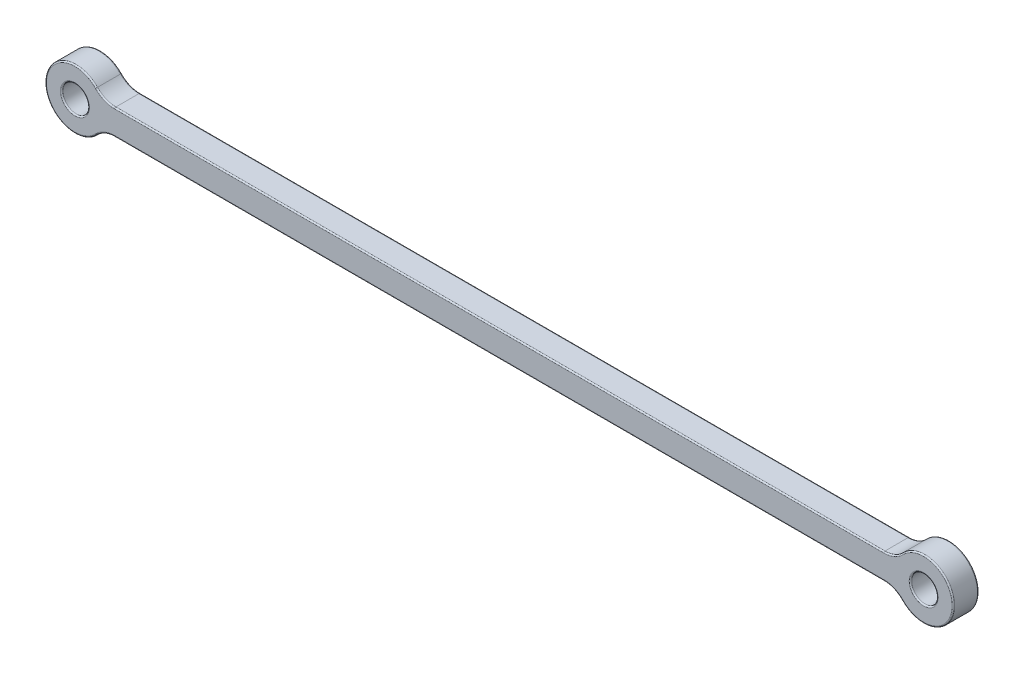
ISO-10303-21;
HEADER;
FILE_DESCRIPTION(('STEP AP214'),'2;1');
FILE_NAME('part.step','',(''),(''),'','','');
FILE_SCHEMA(('AUTOMOTIVE_DESIGN { 1 0 10303 214 1 1 1 1 }'));
ENDSEC;
DATA;
#1=APPLICATION_CONTEXT('core data for automotive mechanical design processes');
#2=APPLICATION_PROTOCOL_DEFINITION('international standard','automotive_design',2000,#1);
#3=PRODUCT_CONTEXT('',#1,'mechanical');
#4=PRODUCT('Part','Part','',(#3));
#5=PRODUCT_RELATED_PRODUCT_CATEGORY('part','',(#4));
#6=PRODUCT_DEFINITION_FORMATION('','',#4);
#7=PRODUCT_DEFINITION_CONTEXT('part definition',#1,'design');
#8=PRODUCT_DEFINITION('design','',#6,#7);
#9=PRODUCT_DEFINITION_SHAPE('','',#8);
#10=(LENGTH_UNIT() NAMED_UNIT(*) SI_UNIT(.MILLI.,.METRE.));
#11=(NAMED_UNIT(*) PLANE_ANGLE_UNIT() SI_UNIT($,.RADIAN.));
#12=(NAMED_UNIT(*) SI_UNIT($,.STERADIAN.) SOLID_ANGLE_UNIT());
#13=UNCERTAINTY_MEASURE_WITH_UNIT(LENGTH_MEASURE(1.E-05),#10,'distance_accuracy_value','');
#14=(GEOMETRIC_REPRESENTATION_CONTEXT(3) GLOBAL_UNCERTAINTY_ASSIGNED_CONTEXT((#13)) GLOBAL_UNIT_ASSIGNED_CONTEXT((#10,
#11,#12)) REPRESENTATION_CONTEXT('',''));
#15=CARTESIAN_POINT('',(0.,0.,0.));
#16=DIRECTION('',(0.,0.,1.));
#17=DIRECTION('',(1.,0.,0.));
#18=AXIS2_PLACEMENT_3D('',#15,#16,#17);
#19=CARTESIAN_POINT('',(0.,1.5,1.5));
#20=DIRECTION('',(0.,-1.,0.));
#21=DIRECTION('',(0.,0.,-1.));
#22=AXIS2_PLACEMENT_3D('',#19,#20,#21);
#23=PLANE('',#22);
#24=DIRECTION('',(0.,0.,-1.));
#25=VECTOR('',#24,1.);
#26=CARTESIAN_POINT('',(95.3095842401766,1.5,1.5));
#27=LINE('',#26,#25);
#28=CARTESIAN_POINT('',(95.3095842401766,1.5,1.35));
#29=VERTEX_POINT('',#28);
#30=CARTESIAN_POINT('',(95.3095842401766,1.5,-1.35));
#31=VERTEX_POINT('',#30);
#32=EDGE_CURVE('E361',#29,#31,#27,.T.);
#33=ORIENTED_EDGE('',*,*,#32,.T.);
#34=DIRECTION('',(-1.,0.,0.));
#35=VECTOR('',#34,1.);
#36=CARTESIAN_POINT('',(0.,1.5,-1.35));
#37=LINE('',#36,#35);
#38=CARTESIAN_POINT('',(4.69041575982343,1.5,-1.35));
#39=VERTEX_POINT('',#38);
#40=EDGE_CURVE('E257',#31,#39,#37,.T.);
#41=ORIENTED_EDGE('',*,*,#40,.T.);
#42=DIRECTION('',(0.,0.,1.));
#43=VECTOR('',#42,1.);
#44=CARTESIAN_POINT('',(4.69041575982343,1.5,1.5));
#45=LINE('',#44,#43);
#46=CARTESIAN_POINT('',(4.69041575982343,1.5,1.35));
#47=VERTEX_POINT('',#46);
#48=EDGE_CURVE('E354',#39,#47,#45,.T.);
#49=ORIENTED_EDGE('',*,*,#48,.T.);
#50=DIRECTION('',(-1.,0.,0.));
#51=VECTOR('',#50,1.);
#52=CARTESIAN_POINT('',(95.3095842401766,1.5,1.35));
#53=LINE('',#52,#51);
#54=EDGE_CURVE('E254',#47,#29,#53,.F.);
#55=ORIENTED_EDGE('',*,*,#54,.T.);
#56=EDGE_LOOP('',(#33,#41,#49,#55));
#57=FACE_BOUND('',#56,.T.);
#58=ADVANCED_FACE('F45',(#57),#23,.F.);
#59=CARTESIAN_POINT('',(0.,0.,1.5));
#60=DIRECTION('',(0.,0.,-1.));
#61=DIRECTION('',(-1.,0.,0.));
#62=AXIS2_PLACEMENT_3D('',#59,#60,#61);
#63=CYLINDRICAL_SURFACE('',#62,3.5);
#64=DIRECTION('',(0.,0.,-1.));
#65=VECTOR('',#64,1.);
#66=CARTESIAN_POINT('',(2.52560848605877,2.42307692307692,1.5));
#67=LINE('',#66,#65);
#68=CARTESIAN_POINT('',(2.52560848605877,2.42307692307692,1.35));
#69=VERTEX_POINT('',#68);
#70=CARTESIAN_POINT('',(2.52560848605877,2.42307692307692,-1.35));
#71=VERTEX_POINT('',#70);
#72=EDGE_CURVE('E356',#69,#71,#67,.T.);
#73=ORIENTED_EDGE('',*,*,#72,.T.);
#74=CARTESIAN_POINT('',(0.,0.,-1.35));
#75=DIRECTION('',(0.,0.,1.));
#76=DIRECTION('',(1.,0.,0.));
#77=AXIS2_PLACEMENT_3D('',#74,#75,#76);
#78=CIRCLE('',#77,3.5);
#79=CARTESIAN_POINT('',(2.52560848605877,-2.42307692307692,-1.35));
#80=VERTEX_POINT('',#79);
#81=EDGE_CURVE('E220',#71,#80,#78,.T.);
#82=ORIENTED_EDGE('',*,*,#81,.T.);
#83=DIRECTION('',(0.,0.,-1.));
#84=VECTOR('',#83,1.);
#85=CARTESIAN_POINT('',(2.52560848605877,-2.42307692307692,1.5));
#86=LINE('',#85,#84);
#87=CARTESIAN_POINT('',(2.52560848605877,-2.42307692307692,1.35));
#88=VERTEX_POINT('',#87);
#89=EDGE_CURVE('E362',#80,#88,#86,.F.);
#90=ORIENTED_EDGE('',*,*,#89,.T.);
#91=CARTESIAN_POINT('',(0.,0.,1.35));
#92=DIRECTION('',(0.,0.,1.));
#93=DIRECTION('',(1.,0.,0.));
#94=AXIS2_PLACEMENT_3D('',#91,#92,#93);
#95=CIRCLE('',#94,3.5);
#96=EDGE_CURVE('E217',#88,#69,#95,.F.);
#97=ORIENTED_EDGE('',*,*,#96,.T.);
#98=EDGE_LOOP('',(#73,#82,#90,#97));
#99=FACE_BOUND('',#98,.T.);
#100=ADVANCED_FACE('F401',(#99),#63,.T.);
#101=CARTESIAN_POINT('',(0.,-1.5,1.5));
#102=DIRECTION('',(0.,-1.,0.));
#103=DIRECTION('',(0.,0.,-1.));
#104=AXIS2_PLACEMENT_3D('',#101,#102,#103);
#105=PLANE('',#104);
#106=DIRECTION('',(0.,0.,-1.));
#107=VECTOR('',#106,1.);
#108=CARTESIAN_POINT('',(4.69041575982343,-1.5,1.5));
#109=LINE('',#108,#107);
#110=CARTESIAN_POINT('',(4.69041575982343,-1.5,1.35));
#111=VERTEX_POINT('',#110);
#112=CARTESIAN_POINT('',(4.69041575982343,-1.5,-1.35));
#113=VERTEX_POINT('',#112);
#114=EDGE_CURVE('E406',#111,#113,#109,.T.);
#115=ORIENTED_EDGE('',*,*,#114,.T.);
#116=DIRECTION('',(-1.,0.,0.));
#117=VECTOR('',#116,1.);
#118=CARTESIAN_POINT('',(95.3095842401766,-1.5,-1.35));
#119=LINE('',#118,#117);
#120=CARTESIAN_POINT('',(95.3095842401766,-1.5,-1.35));
#121=VERTEX_POINT('',#120);
#122=EDGE_CURVE('E232',#113,#121,#119,.F.);
#123=ORIENTED_EDGE('',*,*,#122,.T.);
#124=DIRECTION('',(0.,0.,1.));
#125=VECTOR('',#124,1.);
#126=CARTESIAN_POINT('',(95.3095842401766,-1.5,1.5));
#127=LINE('',#126,#125);
#128=CARTESIAN_POINT('',(95.3095842401766,-1.5,1.35));
#129=VERTEX_POINT('',#128);
#130=EDGE_CURVE('E403',#121,#129,#127,.T.);
#131=ORIENTED_EDGE('',*,*,#130,.T.);
#132=DIRECTION('',(-1.,0.,0.));
#133=VECTOR('',#132,1.);
#134=CARTESIAN_POINT('',(0.,-1.5,1.35));
#135=LINE('',#134,#133);
#136=EDGE_CURVE('E229',#129,#111,#135,.T.);
#137=ORIENTED_EDGE('',*,*,#136,.T.);
#138=EDGE_LOOP('',(#115,#123,#131,#137));
#139=FACE_BOUND('',#138,.T.);
#140=ADVANCED_FACE('F445',(#139),#105,.T.);
#141=CARTESIAN_POINT('',(0.,0.,1.5));
#142=DIRECTION('',(0.,0.,-1.));
#143=DIRECTION('',(-1.,0.,0.));
#144=AXIS2_PLACEMENT_3D('',#141,#142,#143);
#145=CYLINDRICAL_SURFACE('',#144,1.55);
#146=CARTESIAN_POINT('',(0.,0.,-1.35));
#147=DIRECTION('',(0.,0.,1.));
#148=DIRECTION('',(1.,0.,0.));
#149=AXIS2_PLACEMENT_3D('',#146,#147,#148);
#150=CIRCLE('',#149,1.55);
#151=CARTESIAN_POINT('',(1.55,0.,-1.35));
#152=VERTEX_POINT('',#151);
#153=EDGE_CURVE('E208',#152,#152,#150,.F.);
#154=ORIENTED_EDGE('',*,*,#153,.T.);
#155=EDGE_LOOP('',(#154));
#156=FACE_BOUND('',#155,.T.);
#157=CARTESIAN_POINT('',(0.,0.,1.35));
#158=DIRECTION('',(0.,0.,1.));
#159=DIRECTION('',(1.,0.,0.));
#160=AXIS2_PLACEMENT_3D('',#157,#158,#159);
#161=CIRCLE('',#160,1.55);
#162=CARTESIAN_POINT('',(1.55,0.,1.35));
#163=VERTEX_POINT('',#162);
#164=EDGE_CURVE('E204',#163,#163,#161,.T.);
#165=ORIENTED_EDGE('',*,*,#164,.T.);
#166=EDGE_LOOP('',(#165));
#167=FACE_BOUND('',#166,.T.);
#168=ADVANCED_FACE('F736',(#156,#167),#145,.F.);
#169=CARTESIAN_POINT('',(100.,0.,1.5));
#170=DIRECTION('',(0.,0.,-1.));
#171=DIRECTION('',(-1.,0.,0.));
#172=AXIS2_PLACEMENT_3D('',#169,#170,#171);
#173=CYLINDRICAL_SURFACE('',#172,3.50000000000001);
#174=DIRECTION('',(0.,0.,-1.));
#175=VECTOR('',#174,1.);
#176=CARTESIAN_POINT('',(97.4743915139412,-2.42307692307693,1.5));
#177=LINE('',#176,#175);
#178=CARTESIAN_POINT('',(97.4743915139412,-2.42307692307693,1.35));
#179=VERTEX_POINT('',#178);
#180=CARTESIAN_POINT('',(97.4743915139412,-2.42307692307693,-1.35));
#181=VERTEX_POINT('',#180);
#182=EDGE_CURVE('E412',#179,#181,#177,.T.);
#183=ORIENTED_EDGE('',*,*,#182,.T.);
#184=CARTESIAN_POINT('',(100.,0.,-1.35));
#185=DIRECTION('',(0.,0.,1.));
#186=DIRECTION('',(1.,0.,0.));
#187=AXIS2_PLACEMENT_3D('',#184,#185,#186);
#188=CIRCLE('',#187,3.50000000000001);
#189=CARTESIAN_POINT('',(97.4743915139412,2.42307692307693,-1.35));
#190=VERTEX_POINT('',#189);
#191=EDGE_CURVE('E245',#181,#190,#188,.T.);
#192=ORIENTED_EDGE('',*,*,#191,.T.);
#193=DIRECTION('',(0.,0.,-1.));
#194=VECTOR('',#193,1.);
#195=CARTESIAN_POINT('',(97.4743915139412,2.42307692307693,1.5));
#196=LINE('',#195,#194);
#197=CARTESIAN_POINT('',(97.4743915139412,2.42307692307693,1.35));
#198=VERTEX_POINT('',#197);
#199=EDGE_CURVE('E309',#190,#198,#196,.F.);
#200=ORIENTED_EDGE('',*,*,#199,.T.);
#201=CARTESIAN_POINT('',(100.,0.,1.35));
#202=DIRECTION('',(0.,0.,1.));
#203=DIRECTION('',(1.,0.,0.));
#204=AXIS2_PLACEMENT_3D('',#201,#202,#203);
#205=CIRCLE('',#204,3.50000000000001);
#206=EDGE_CURVE('E242',#198,#179,#205,.F.);
#207=ORIENTED_EDGE('',*,*,#206,.T.);
#208=EDGE_LOOP('',(#183,#192,#200,#207));
#209=FACE_BOUND('',#208,.T.);
#210=ADVANCED_FACE('F421',(#209),#173,.T.);
#211=CARTESIAN_POINT('',(100.,0.,1.5));
#212=DIRECTION('',(0.,0.,-1.));
#213=DIRECTION('',(-1.,0.,0.));
#214=AXIS2_PLACEMENT_3D('',#211,#212,#213);
#215=CYLINDRICAL_SURFACE('',#214,1.54999999999999);
#216=CARTESIAN_POINT('',(100.,0.,-1.35));
#217=DIRECTION('',(0.,0.,1.));
#218=DIRECTION('',(1.,0.,0.));
#219=AXIS2_PLACEMENT_3D('',#216,#217,#218);
#220=CIRCLE('',#219,1.54999999999999);
#221=CARTESIAN_POINT('',(101.55,0.,-1.35));
#222=VERTEX_POINT('',#221);
#223=EDGE_CURVE('E183',#222,#222,#220,.F.);
#224=ORIENTED_EDGE('',*,*,#223,.T.);
#225=EDGE_LOOP('',(#224));
#226=FACE_BOUND('',#225,.T.);
#227=CARTESIAN_POINT('',(100.,0.,1.35));
#228=DIRECTION('',(0.,0.,1.));
#229=DIRECTION('',(1.,0.,0.));
#230=AXIS2_PLACEMENT_3D('',#227,#228,#229);
#231=CIRCLE('',#230,1.54999999999999);
#232=CARTESIAN_POINT('',(101.55,0.,1.35));
#233=VERTEX_POINT('',#232);
#234=EDGE_CURVE('E366',#233,#233,#231,.T.);
#235=ORIENTED_EDGE('',*,*,#234,.T.);
#236=EDGE_LOOP('',(#235));
#237=FACE_BOUND('',#236,.T.);
#238=ADVANCED_FACE('F713',(#226,#237),#215,.F.);
#239=CARTESIAN_POINT('',(0.,0.,1.5));
#240=DIRECTION('',(0.,0.,1.));
#241=DIRECTION('',(1.,0.,0.));
#242=AXIS2_PLACEMENT_3D('',#239,#240,#241);
#243=PLANE('',#242);
#244=CARTESIAN_POINT('',(100.,0.,1.5));
#245=DIRECTION('',(0.,0.,1.));
#246=DIRECTION('',(1.,0.,0.));
#247=AXIS2_PLACEMENT_3D('',#244,#245,#246);
#248=CIRCLE('',#247,1.69999999999999);
#249=CARTESIAN_POINT('',(101.7,0.,1.5));
#250=VERTEX_POINT('',#249);
#251=EDGE_CURVE('E11',#250,#250,#248,.F.);
#252=ORIENTED_EDGE('',*,*,#251,.T.);
#253=EDGE_LOOP('',(#252));
#254=FACE_BOUND('',#253,.T.);
#255=CARTESIAN_POINT('',(0.,0.,1.5));
#256=DIRECTION('',(0.,0.,1.));
#257=DIRECTION('',(1.,0.,0.));
#258=AXIS2_PLACEMENT_3D('',#255,#256,#257);
#259=CIRCLE('',#258,1.7);
#260=CARTESIAN_POINT('',(1.7,0.,1.5));
#261=VERTEX_POINT('',#260);
#262=EDGE_CURVE('E55',#261,#261,#259,.F.);
#263=ORIENTED_EDGE('',*,*,#262,.T.);
#264=EDGE_LOOP('',(#263));
#265=FACE_BOUND('',#264,.T.);
#266=DIRECTION('',(-1.,0.,0.));
#267=VECTOR('',#266,1.);
#268=CARTESIAN_POINT('',(0.,-1.35,1.5));
#269=LINE('',#268,#267);
#270=CARTESIAN_POINT('',(4.69041575982343,-1.35,1.5));
#271=VERTEX_POINT('',#270);
#272=CARTESIAN_POINT('',(95.3095842401766,-1.35,1.5));
#273=VERTEX_POINT('',#272);
#274=EDGE_CURVE('E63',#271,#273,#269,.F.);
#275=ORIENTED_EDGE('',*,*,#274,.T.);
#276=CARTESIAN_POINT('',(95.3095842401766,-4.5,1.5));
#277=DIRECTION('',(0.,0.,1.));
#278=DIRECTION('',(1.,0.,0.));
#279=AXIS2_PLACEMENT_3D('',#276,#277,#278);
#280=CIRCLE('',#279,3.15);
#281=CARTESIAN_POINT('',(97.5826318776295,-2.31923076923077,1.5));
#282=VERTEX_POINT('',#281);
#283=EDGE_CURVE('E279',#273,#282,#280,.F.);
#284=ORIENTED_EDGE('',*,*,#283,.T.);
#285=CARTESIAN_POINT('',(100.,0.,1.5));
#286=DIRECTION('',(0.,0.,1.));
#287=DIRECTION('',(1.,0.,0.));
#288=AXIS2_PLACEMENT_3D('',#285,#286,#287);
#289=CIRCLE('',#288,3.35000000000001);
#290=CARTESIAN_POINT('',(97.5826318776295,2.31923076923077,1.5));
#291=VERTEX_POINT('',#290);
#292=EDGE_CURVE('E260',#282,#291,#289,.T.);
#293=ORIENTED_EDGE('',*,*,#292,.T.);
#294=CARTESIAN_POINT('',(95.3095842401766,4.5,1.5));
#295=DIRECTION('',(0.,0.,1.));
#296=DIRECTION('',(1.,0.,0.));
#297=AXIS2_PLACEMENT_3D('',#294,#295,#296);
#298=CIRCLE('',#297,3.15);
#299=CARTESIAN_POINT('',(95.3095842401766,1.35,1.5));
#300=VERTEX_POINT('',#299);
#301=EDGE_CURVE('E263',#291,#300,#298,.F.);
#302=ORIENTED_EDGE('',*,*,#301,.T.);
#303=DIRECTION('',(-1.,0.,0.));
#304=VECTOR('',#303,1.);
#305=CARTESIAN_POINT('',(4.69041575982343,1.35,1.5));
#306=LINE('',#305,#304);
#307=CARTESIAN_POINT('',(4.69041575982343,1.35,1.5));
#308=VERTEX_POINT('',#307);
#309=EDGE_CURVE('E266',#300,#308,#306,.T.);
#310=ORIENTED_EDGE('',*,*,#309,.T.);
#311=CARTESIAN_POINT('',(4.69041575982343,4.5,1.5));
#312=DIRECTION('',(0.,0.,1.));
#313=DIRECTION('',(1.,0.,0.));
#314=AXIS2_PLACEMENT_3D('',#311,#312,#313);
#315=CIRCLE('',#314,3.15);
#316=CARTESIAN_POINT('',(2.41736812237054,2.31923076923077,1.5));
#317=VERTEX_POINT('',#316);
#318=EDGE_CURVE('E269',#308,#317,#315,.F.);
#319=ORIENTED_EDGE('',*,*,#318,.T.);
#320=CARTESIAN_POINT('',(0.,0.,1.5));
#321=DIRECTION('',(0.,0.,1.));
#322=DIRECTION('',(1.,0.,0.));
#323=AXIS2_PLACEMENT_3D('',#320,#321,#322);
#324=CIRCLE('',#323,3.35);
#325=CARTESIAN_POINT('',(2.41736812237054,-2.31923076923077,1.5));
#326=VERTEX_POINT('',#325);
#327=EDGE_CURVE('E272',#317,#326,#324,.T.);
#328=ORIENTED_EDGE('',*,*,#327,.T.);
#329=CARTESIAN_POINT('',(4.69041575982343,-4.5,1.5));
#330=DIRECTION('',(0.,0.,1.));
#331=DIRECTION('',(1.,0.,0.));
#332=AXIS2_PLACEMENT_3D('',#329,#330,#331);
#333=CIRCLE('',#332,3.15);
#334=EDGE_CURVE('E68',#326,#271,#333,.F.);
#335=ORIENTED_EDGE('',*,*,#334,.T.);
#336=EDGE_LOOP('',(#275,#284,#293,#302,#310,#319,#328,#335));
#337=FACE_BOUND('',#336,.T.);
#338=ADVANCED_FACE('F464',(#254,#265,#337),#243,.T.);
#339=CARTESIAN_POINT('',(0.,0.,-1.5));
#340=DIRECTION('',(0.,0.,1.));
#341=DIRECTION('',(1.,0.,0.));
#342=AXIS2_PLACEMENT_3D('',#339,#340,#341);
#343=PLANE('',#342);
#344=CARTESIAN_POINT('',(100.,0.,-1.5));
#345=DIRECTION('',(0.,0.,1.));
#346=DIRECTION('',(1.,0.,0.));
#347=AXIS2_PLACEMENT_3D('',#344,#345,#346);
#348=CIRCLE('',#347,1.69999999999999);
#349=CARTESIAN_POINT('',(101.7,0.,-1.5));
#350=VERTEX_POINT('',#349);
#351=EDGE_CURVE('E195',#350,#350,#348,.T.);
#352=ORIENTED_EDGE('',*,*,#351,.T.);
#353=EDGE_LOOP('',(#352));
#354=FACE_BOUND('',#353,.T.);
#355=CARTESIAN_POINT('',(0.,0.,-1.5));
#356=DIRECTION('',(0.,0.,1.));
#357=DIRECTION('',(1.,0.,0.));
#358=AXIS2_PLACEMENT_3D('',#355,#356,#357);
#359=CIRCLE('',#358,1.7);
#360=CARTESIAN_POINT('',(1.7,0.,-1.5));
#361=VERTEX_POINT('',#360);
#362=EDGE_CURVE('E190',#361,#361,#359,.T.);
#363=ORIENTED_EDGE('',*,*,#362,.T.);
#364=EDGE_LOOP('',(#363));
#365=FACE_BOUND('',#364,.T.);
#366=CARTESIAN_POINT('',(0.,0.,-1.5));
#367=DIRECTION('',(0.,0.,1.));
#368=DIRECTION('',(1.,0.,0.));
#369=AXIS2_PLACEMENT_3D('',#366,#367,#368);
#370=CIRCLE('',#369,3.35);
#371=CARTESIAN_POINT('',(2.41736812237054,-2.31923076923077,-1.5));
#372=VERTEX_POINT('',#371);
#373=CARTESIAN_POINT('',(2.41736812237054,2.31923076923077,-1.5));
#374=VERTEX_POINT('',#373);
#375=EDGE_CURVE('E187',#372,#374,#370,.F.);
#376=ORIENTED_EDGE('',*,*,#375,.T.);
#377=CARTESIAN_POINT('',(4.69041575982343,4.5,-1.5));
#378=DIRECTION('',(0.,0.,1.));
#379=DIRECTION('',(1.,0.,0.));
#380=AXIS2_PLACEMENT_3D('',#377,#378,#379);
#381=CIRCLE('',#380,3.15);
#382=CARTESIAN_POINT('',(4.69041575982343,1.35,-1.5));
#383=VERTEX_POINT('',#382);
#384=EDGE_CURVE('E166',#374,#383,#381,.T.);
#385=ORIENTED_EDGE('',*,*,#384,.T.);
#386=DIRECTION('',(-1.,0.,0.));
#387=VECTOR('',#386,1.);
#388=CARTESIAN_POINT('',(0.,1.35,-1.5));
#389=LINE('',#388,#387);
#390=CARTESIAN_POINT('',(95.3095842401766,1.35,-1.5));
#391=VERTEX_POINT('',#390);
#392=EDGE_CURVE('E175',#383,#391,#389,.F.);
#393=ORIENTED_EDGE('',*,*,#392,.T.);
#394=CARTESIAN_POINT('',(95.3095842401766,4.5,-1.5));
#395=DIRECTION('',(0.,0.,1.));
#396=DIRECTION('',(1.,0.,0.));
#397=AXIS2_PLACEMENT_3D('',#394,#395,#396);
#398=CIRCLE('',#397,3.15);
#399=CARTESIAN_POINT('',(97.5826318776295,2.31923076923077,-1.5));
#400=VERTEX_POINT('',#399);
#401=EDGE_CURVE('E182',#391,#400,#398,.T.);
#402=ORIENTED_EDGE('',*,*,#401,.T.);
#403=CARTESIAN_POINT('',(100.,0.,-1.5));
#404=DIRECTION('',(0.,0.,1.));
#405=DIRECTION('',(1.,0.,0.));
#406=AXIS2_PLACEMENT_3D('',#403,#404,#405);
#407=CIRCLE('',#406,3.35000000000001);
#408=CARTESIAN_POINT('',(97.5826318776295,-2.31923076923077,-1.5));
#409=VERTEX_POINT('',#408);
#410=EDGE_CURVE('E380',#400,#409,#407,.F.);
#411=ORIENTED_EDGE('',*,*,#410,.T.);
#412=CARTESIAN_POINT('',(95.3095842401766,-4.5,-1.5));
#413=DIRECTION('',(0.,0.,1.));
#414=DIRECTION('',(1.,0.,0.));
#415=AXIS2_PLACEMENT_3D('',#412,#413,#414);
#416=CIRCLE('',#415,3.15);
#417=CARTESIAN_POINT('',(95.3095842401766,-1.35,-1.5));
#418=VERTEX_POINT('',#417);
#419=EDGE_CURVE('E383',#409,#418,#416,.T.);
#420=ORIENTED_EDGE('',*,*,#419,.T.);
#421=DIRECTION('',(-1.,0.,0.));
#422=VECTOR('',#421,1.);
#423=CARTESIAN_POINT('',(4.69041575982343,-1.35,-1.5));
#424=LINE('',#423,#422);
#425=CARTESIAN_POINT('',(4.69041575982343,-1.35,-1.5));
#426=VERTEX_POINT('',#425);
#427=EDGE_CURVE('E386',#418,#426,#424,.T.);
#428=ORIENTED_EDGE('',*,*,#427,.T.);
#429=CARTESIAN_POINT('',(4.69041575982343,-4.5,-1.5));
#430=DIRECTION('',(0.,0.,1.));
#431=DIRECTION('',(1.,0.,0.));
#432=AXIS2_PLACEMENT_3D('',#429,#430,#431);
#433=CIRCLE('',#432,3.15);
#434=EDGE_CURVE('E197',#426,#372,#433,.T.);
#435=ORIENTED_EDGE('',*,*,#434,.T.);
#436=EDGE_LOOP('',(#376,#385,#393,#402,#411,#420,#428,#435));
#437=FACE_BOUND('',#436,.T.);
#438=ADVANCED_FACE('F185',(#354,#365,#437),#343,.F.);
#439=CARTESIAN_POINT('',(95.3095842401766,-4.5,1.5));
#440=DIRECTION('',(0.,0.,-1.));
#441=DIRECTION('',(-1.,0.,0.));
#442=AXIS2_PLACEMENT_3D('',#439,#440,#441);
#443=CYLINDRICAL_SURFACE('',#442,3.);
#444=ORIENTED_EDGE('',*,*,#130,.F.);
#445=CARTESIAN_POINT('',(95.3095842401766,-4.5,-1.35));
#446=DIRECTION('',(0.,0.,1.));
#447=DIRECTION('',(1.,0.,0.));
#448=AXIS2_PLACEMENT_3D('',#445,#446,#447);
#449=CIRCLE('',#448,3.);
#450=EDGE_CURVE('E239',#121,#181,#449,.F.);
#451=ORIENTED_EDGE('',*,*,#450,.T.);
#452=ORIENTED_EDGE('',*,*,#182,.F.);
#453=CARTESIAN_POINT('',(95.3095842401766,-4.5,1.35));
#454=DIRECTION('',(0.,0.,1.));
#455=DIRECTION('',(1.,0.,0.));
#456=AXIS2_PLACEMENT_3D('',#453,#454,#455);
#457=CIRCLE('',#456,3.);
#458=EDGE_CURVE('E235',#179,#129,#457,.T.);
#459=ORIENTED_EDGE('',*,*,#458,.T.);
#460=EDGE_LOOP('',(#444,#451,#452,#459));
#461=FACE_BOUND('',#460,.T.);
#462=ADVANCED_FACE('F442',(#461),#443,.F.);
#463=CARTESIAN_POINT('',(4.69041575982343,-4.5,1.5));
#464=DIRECTION('',(0.,0.,-1.));
#465=DIRECTION('',(-1.,0.,0.));
#466=AXIS2_PLACEMENT_3D('',#463,#464,#465);
#467=CYLINDRICAL_SURFACE('',#466,3.);
#468=ORIENTED_EDGE('',*,*,#89,.F.);
#469=CARTESIAN_POINT('',(4.69041575982343,-4.5,-1.35));
#470=DIRECTION('',(0.,0.,1.));
#471=DIRECTION('',(1.,0.,0.));
#472=AXIS2_PLACEMENT_3D('',#469,#470,#471);
#473=CIRCLE('',#472,3.);
#474=EDGE_CURVE('E226',#80,#113,#473,.F.);
#475=ORIENTED_EDGE('',*,*,#474,.T.);
#476=ORIENTED_EDGE('',*,*,#114,.F.);
#477=CARTESIAN_POINT('',(4.69041575982343,-4.5,1.35));
#478=DIRECTION('',(0.,0.,1.));
#479=DIRECTION('',(1.,0.,0.));
#480=AXIS2_PLACEMENT_3D('',#477,#478,#479);
#481=CIRCLE('',#480,3.);
#482=EDGE_CURVE('E223',#111,#88,#481,.T.);
#483=ORIENTED_EDGE('',*,*,#482,.T.);
#484=EDGE_LOOP('',(#468,#475,#476,#483));
#485=FACE_BOUND('',#484,.T.);
#486=ADVANCED_FACE('F488',(#485),#467,.F.);
#487=CARTESIAN_POINT('',(95.3095842401766,4.5,1.5));
#488=DIRECTION('',(0.,0.,-1.));
#489=DIRECTION('',(-1.,0.,0.));
#490=AXIS2_PLACEMENT_3D('',#487,#488,#489);
#491=CYLINDRICAL_SURFACE('',#490,3.);
#492=ORIENTED_EDGE('',*,*,#199,.F.);
#493=CARTESIAN_POINT('',(95.3095842401766,4.5,-1.35));
#494=DIRECTION('',(0.,0.,1.));
#495=DIRECTION('',(1.,0.,0.));
#496=AXIS2_PLACEMENT_3D('',#493,#494,#495);
#497=CIRCLE('',#496,3.);
#498=EDGE_CURVE('E251',#190,#31,#497,.F.);
#499=ORIENTED_EDGE('',*,*,#498,.T.);
#500=ORIENTED_EDGE('',*,*,#32,.F.);
#501=CARTESIAN_POINT('',(95.3095842401766,4.5,1.35));
#502=DIRECTION('',(0.,0.,1.));
#503=DIRECTION('',(1.,0.,0.));
#504=AXIS2_PLACEMENT_3D('',#501,#502,#503);
#505=CIRCLE('',#504,3.);
#506=EDGE_CURVE('E248',#29,#198,#505,.T.);
#507=ORIENTED_EDGE('',*,*,#506,.T.);
#508=EDGE_LOOP('',(#492,#499,#500,#507));
#509=FACE_BOUND('',#508,.T.);
#510=ADVANCED_FACE('F461',(#509),#491,.F.);
#511=CARTESIAN_POINT('',(4.69041575982343,4.5,1.5));
#512=DIRECTION('',(0.,0.,-1.));
#513=DIRECTION('',(-1.,0.,0.));
#514=AXIS2_PLACEMENT_3D('',#511,#512,#513);
#515=CYLINDRICAL_SURFACE('',#514,3.);
#516=ORIENTED_EDGE('',*,*,#48,.F.);
#517=CARTESIAN_POINT('',(4.69041575982343,4.5,-1.35));
#518=DIRECTION('',(0.,0.,1.));
#519=DIRECTION('',(1.,0.,0.));
#520=AXIS2_PLACEMENT_3D('',#517,#518,#519);
#521=CIRCLE('',#520,3.);
#522=EDGE_CURVE('E168',#39,#71,#521,.F.);
#523=ORIENTED_EDGE('',*,*,#522,.T.);
#524=ORIENTED_EDGE('',*,*,#72,.F.);
#525=CARTESIAN_POINT('',(4.69041575982343,4.5,1.35));
#526=DIRECTION('',(0.,0.,1.));
#527=DIRECTION('',(1.,0.,0.));
#528=AXIS2_PLACEMENT_3D('',#525,#526,#527);
#529=CIRCLE('',#528,3.);
#530=EDGE_CURVE('E212',#69,#47,#529,.T.);
#531=ORIENTED_EDGE('',*,*,#530,.T.);
#532=EDGE_LOOP('',(#516,#523,#524,#531));
#533=FACE_BOUND('',#532,.T.);
#534=ADVANCED_FACE('F353',(#533),#515,.F.);
#535=CARTESIAN_POINT('',(100.,0.,-1.35));
#536=DIRECTION('',(0.,0.,1.));
#537=DIRECTION('',(1.,0.,0.));
#538=AXIS2_PLACEMENT_3D('',#535,#536,#537);
#539=TOROIDAL_SURFACE('',#538,1.69999999999999,0.15);
#540=ORIENTED_EDGE('',*,*,#351,.F.);
#541=EDGE_LOOP('',(#540));
#542=FACE_BOUND('',#541,.T.);
#543=ORIENTED_EDGE('',*,*,#223,.F.);
#544=EDGE_LOOP('',(#543));
#545=FACE_BOUND('',#544,.T.);
#546=ADVANCED_FACE('F496',(#542,#545),#539,.T.);
#547=CARTESIAN_POINT('',(0.,0.,-1.35));
#548=DIRECTION('',(0.,0.,1.));
#549=DIRECTION('',(1.,0.,0.));
#550=AXIS2_PLACEMENT_3D('',#547,#548,#549);
#551=TOROIDAL_SURFACE('',#550,1.7,0.15);
#552=ORIENTED_EDGE('',*,*,#153,.F.);
#553=EDGE_LOOP('',(#552));
#554=FACE_BOUND('',#553,.T.);
#555=ORIENTED_EDGE('',*,*,#362,.F.);
#556=EDGE_LOOP('',(#555));
#557=FACE_BOUND('',#556,.T.);
#558=ADVANCED_FACE('F499',(#554,#557),#551,.T.);
#559=CARTESIAN_POINT('',(95.3095842401766,-4.5,-1.35));
#560=DIRECTION('',(0.,0.,1.));
#561=DIRECTION('',(1.,0.,0.));
#562=AXIS2_PLACEMENT_3D('',#559,#560,#561);
#563=TOROIDAL_SURFACE('',#562,3.15,0.15);
#564=CARTESIAN_POINT('',(97.5826318776295,-2.31923076923078,-1.35));
#565=DIRECTION('',(0.692307692307708,-0.721602424588204,0.));
#566=DIRECTION('',(0.721602424588204,0.692307692307708,0.));
#567=AXIS2_PLACEMENT_3D('',#564,#565,#566);
#568=CIRCLE('',#567,0.15);
#569=EDGE_CURVE('E301',#181,#409,#568,.T.);
#570=ORIENTED_EDGE('',*,*,#569,.F.);
#571=ORIENTED_EDGE('',*,*,#450,.F.);
#572=CARTESIAN_POINT('',(95.3095842401766,-1.35,-1.35));
#573=DIRECTION('',(-1.,0.,0.));
#574=DIRECTION('',(0.,0.,1.));
#575=AXIS2_PLACEMENT_3D('',#572,#573,#574);
#576=CIRCLE('',#575,0.15);
#577=EDGE_CURVE('E305',#418,#121,#576,.T.);
#578=ORIENTED_EDGE('',*,*,#577,.F.);
#579=ORIENTED_EDGE('',*,*,#419,.F.);
#580=EDGE_LOOP('',(#570,#571,#578,#579));
#581=FACE_BOUND('',#580,.T.);
#582=ADVANCED_FACE('F454',(#581),#563,.T.);
#583=CARTESIAN_POINT('',(0.,-1.35,-1.35));
#584=DIRECTION('',(1.,0.,0.));
#585=DIRECTION('',(0.,0.,-1.));
#586=AXIS2_PLACEMENT_3D('',#583,#584,#585);
#587=CYLINDRICAL_SURFACE('',#586,0.15);
#588=ORIENTED_EDGE('',*,*,#577,.T.);
#589=ORIENTED_EDGE('',*,*,#122,.F.);
#590=CARTESIAN_POINT('',(4.69041575982343,-1.35,-1.35));
#591=DIRECTION('',(-1.,0.,0.));
#592=DIRECTION('',(0.,0.,1.));
#593=AXIS2_PLACEMENT_3D('',#590,#591,#592);
#594=CIRCLE('',#593,0.15);
#595=EDGE_CURVE('E297',#426,#113,#594,.T.);
#596=ORIENTED_EDGE('',*,*,#595,.F.);
#597=ORIENTED_EDGE('',*,*,#427,.F.);
#598=EDGE_LOOP('',(#588,#589,#596,#597));
#599=FACE_BOUND('',#598,.T.);
#600=ADVANCED_FACE('F449',(#599),#587,.T.);
#601=CARTESIAN_POINT('',(100.,0.,-1.35));
#602=DIRECTION('',(0.,0.,1.));
#603=DIRECTION('',(1.,0.,0.));
#604=AXIS2_PLACEMENT_3D('',#601,#602,#603);
#605=TOROIDAL_SURFACE('',#604,3.35000000000001,0.15);
#606=ORIENTED_EDGE('',*,*,#569,.T.);
#607=ORIENTED_EDGE('',*,*,#410,.F.);
#608=CARTESIAN_POINT('',(97.5826318776295,2.31923076923077,-1.35));
#609=DIRECTION('',(-0.692307692307708,-0.721602424588204,0.));
#610=DIRECTION('',(0.721602424588204,-0.692307692307708,0.));
#611=AXIS2_PLACEMENT_3D('',#608,#609,#610);
#612=CIRCLE('',#611,0.15);
#613=EDGE_CURVE('E293',#190,#400,#612,.T.);
#614=ORIENTED_EDGE('',*,*,#613,.F.);
#615=ORIENTED_EDGE('',*,*,#191,.F.);
#616=EDGE_LOOP('',(#606,#607,#614,#615));
#617=FACE_BOUND('',#616,.T.);
#618=ADVANCED_FACE('F457',(#617),#605,.T.);
#619=CARTESIAN_POINT('',(4.69041575982343,-4.5,-1.35));
#620=DIRECTION('',(0.,0.,1.));
#621=DIRECTION('',(1.,0.,0.));
#622=AXIS2_PLACEMENT_3D('',#619,#620,#621);
#623=TOROIDAL_SURFACE('',#622,3.15,0.15);
#624=ORIENTED_EDGE('',*,*,#595,.T.);
#625=ORIENTED_EDGE('',*,*,#474,.F.);
#626=CARTESIAN_POINT('',(2.41736812237054,-2.31923076923077,-1.35));
#627=DIRECTION('',(-0.692307692307693,-0.72160242458822,0.));
#628=DIRECTION('',(0.72160242458822,-0.692307692307693,0.));
#629=AXIS2_PLACEMENT_3D('',#626,#627,#628);
#630=CIRCLE('',#629,0.15);
#631=EDGE_CURVE('E289',#372,#80,#630,.T.);
#632=ORIENTED_EDGE('',*,*,#631,.F.);
#633=ORIENTED_EDGE('',*,*,#434,.F.);
#634=EDGE_LOOP('',(#624,#625,#632,#633));
#635=FACE_BOUND('',#634,.T.);
#636=ADVANCED_FACE('F395',(#635),#623,.T.);
#637=CARTESIAN_POINT('',(95.3095842401766,4.5,-1.35));
#638=DIRECTION('',(0.,0.,1.));
#639=DIRECTION('',(1.,0.,0.));
#640=AXIS2_PLACEMENT_3D('',#637,#638,#639);
#641=TOROIDAL_SURFACE('',#640,3.15,0.15);
#642=ORIENTED_EDGE('',*,*,#613,.T.);
#643=ORIENTED_EDGE('',*,*,#401,.F.);
#644=CARTESIAN_POINT('',(95.3095842401766,1.35,-1.35));
#645=DIRECTION('',(-1.,0.,0.));
#646=DIRECTION('',(0.,0.,1.));
#647=AXIS2_PLACEMENT_3D('',#644,#645,#646);
#648=CIRCLE('',#647,0.15);
#649=EDGE_CURVE('E178',#31,#391,#648,.T.);
#650=ORIENTED_EDGE('',*,*,#649,.F.);
#651=ORIENTED_EDGE('',*,*,#498,.F.);
#652=EDGE_LOOP('',(#642,#643,#650,#651));
#653=FACE_BOUND('',#652,.T.);
#654=ADVANCED_FACE('F460',(#653),#641,.T.);
#655=CARTESIAN_POINT('',(0.,0.,-1.35));
#656=DIRECTION('',(0.,0.,1.));
#657=DIRECTION('',(1.,0.,0.));
#658=AXIS2_PLACEMENT_3D('',#655,#656,#657);
#659=TOROIDAL_SURFACE('',#658,3.35,0.15);
#660=ORIENTED_EDGE('',*,*,#631,.T.);
#661=ORIENTED_EDGE('',*,*,#81,.F.);
#662=CARTESIAN_POINT('',(2.41736812237054,2.31923076923077,-1.35));
#663=DIRECTION('',(0.692307692307693,-0.72160242458822,0.));
#664=DIRECTION('',(0.72160242458822,0.692307692307693,0.));
#665=AXIS2_PLACEMENT_3D('',#662,#663,#664);
#666=CIRCLE('',#665,0.15);
#667=EDGE_CURVE('E172',#374,#71,#666,.T.);
#668=ORIENTED_EDGE('',*,*,#667,.F.);
#669=ORIENTED_EDGE('',*,*,#375,.F.);
#670=EDGE_LOOP('',(#660,#661,#668,#669));
#671=FACE_BOUND('',#670,.T.);
#672=ADVANCED_FACE('F398',(#671),#659,.T.);
#673=CARTESIAN_POINT('',(0.,1.35,-1.35));
#674=DIRECTION('',(-1.,0.,0.));
#675=DIRECTION('',(0.,0.,1.));
#676=AXIS2_PLACEMENT_3D('',#673,#674,#675);
#677=CYLINDRICAL_SURFACE('',#676,0.15);
#678=ORIENTED_EDGE('',*,*,#649,.T.);
#679=ORIENTED_EDGE('',*,*,#392,.F.);
#680=CARTESIAN_POINT('',(4.69041575982343,1.35,-1.35));
#681=DIRECTION('',(-1.,0.,0.));
#682=DIRECTION('',(0.,0.,1.));
#683=AXIS2_PLACEMENT_3D('',#680,#681,#682);
#684=CIRCLE('',#683,0.15);
#685=EDGE_CURVE('E162',#39,#383,#684,.T.);
#686=ORIENTED_EDGE('',*,*,#685,.F.);
#687=ORIENTED_EDGE('',*,*,#40,.F.);
#688=EDGE_LOOP('',(#678,#679,#686,#687));
#689=FACE_BOUND('',#688,.T.);
#690=ADVANCED_FACE('F176',(#689),#677,.T.);
#691=CARTESIAN_POINT('',(4.69041575982343,4.5,-1.35));
#692=DIRECTION('',(0.,0.,1.));
#693=DIRECTION('',(1.,0.,0.));
#694=AXIS2_PLACEMENT_3D('',#691,#692,#693);
#695=TOROIDAL_SURFACE('',#694,3.15,0.15);
#696=ORIENTED_EDGE('',*,*,#667,.T.);
#697=ORIENTED_EDGE('',*,*,#522,.F.);
#698=ORIENTED_EDGE('',*,*,#685,.T.);
#699=ORIENTED_EDGE('',*,*,#384,.F.);
#700=EDGE_LOOP('',(#696,#697,#698,#699));
#701=FACE_BOUND('',#700,.T.);
#702=ADVANCED_FACE('F164',(#701),#695,.T.);
#703=CARTESIAN_POINT('',(100.,0.,1.35));
#704=DIRECTION('',(0.,0.,1.));
#705=DIRECTION('',(1.,0.,0.));
#706=AXIS2_PLACEMENT_3D('',#703,#704,#705);
#707=TOROIDAL_SURFACE('',#706,1.69999999999999,0.15);
#708=ORIENTED_EDGE('',*,*,#234,.F.);
#709=EDGE_LOOP('',(#708));
#710=FACE_BOUND('',#709,.T.);
#711=ORIENTED_EDGE('',*,*,#251,.F.);
#712=EDGE_LOOP('',(#711));
#713=FACE_BOUND('',#712,.T.);
#714=ADVANCED_FACE('F506',(#710,#713),#707,.T.);
#715=CARTESIAN_POINT('',(0.,0.,1.35));
#716=DIRECTION('',(0.,0.,1.));
#717=DIRECTION('',(1.,0.,0.));
#718=AXIS2_PLACEMENT_3D('',#715,#716,#717);
#719=TOROIDAL_SURFACE('',#718,1.7,0.15);
#720=ORIENTED_EDGE('',*,*,#262,.F.);
#721=EDGE_LOOP('',(#720));
#722=FACE_BOUND('',#721,.T.);
#723=ORIENTED_EDGE('',*,*,#164,.F.);
#724=EDGE_LOOP('',(#723));
#725=FACE_BOUND('',#724,.T.);
#726=ADVANCED_FACE('F523',(#722,#725),#719,.T.);
#727=CARTESIAN_POINT('',(4.69041575982343,4.5,1.35));
#728=DIRECTION('',(0.,0.,1.));
#729=DIRECTION('',(1.,0.,0.));
#730=AXIS2_PLACEMENT_3D('',#727,#728,#729);
#731=TOROIDAL_SURFACE('',#730,3.15,0.15);
#732=CARTESIAN_POINT('',(4.69041575982343,1.35,1.35));
#733=DIRECTION('',(1.,0.,0.));
#734=DIRECTION('',(0.,0.,-1.));
#735=AXIS2_PLACEMENT_3D('',#732,#733,#734);
#736=CIRCLE('',#735,0.15);
#737=EDGE_CURVE('E331',#47,#308,#736,.T.);
#738=ORIENTED_EDGE('',*,*,#737,.F.);
#739=ORIENTED_EDGE('',*,*,#530,.F.);
#740=CARTESIAN_POINT('',(2.41736812237054,2.31923076923077,1.35));
#741=DIRECTION('',(-0.692307692307693,0.72160242458822,0.));
#742=DIRECTION('',(-0.72160242458822,-0.692307692307693,0.));
#743=AXIS2_PLACEMENT_3D('',#740,#741,#742);
#744=CIRCLE('',#743,0.15);
#745=EDGE_CURVE('E49',#317,#69,#744,.T.);
#746=ORIENTED_EDGE('',*,*,#745,.F.);
#747=ORIENTED_EDGE('',*,*,#318,.F.);
#748=EDGE_LOOP('',(#738,#739,#746,#747));
#749=FACE_BOUND('',#748,.T.);
#750=ADVANCED_FACE('F47',(#749),#731,.T.);
#751=CARTESIAN_POINT('',(0.,0.,1.35));
#752=DIRECTION('',(0.,0.,1.));
#753=DIRECTION('',(1.,0.,0.));
#754=AXIS2_PLACEMENT_3D('',#751,#752,#753);
#755=TOROIDAL_SURFACE('',#754,3.35,0.15);
#756=ORIENTED_EDGE('',*,*,#745,.T.);
#757=ORIENTED_EDGE('',*,*,#96,.F.);
#758=CARTESIAN_POINT('',(2.41736812237054,-2.31923076923077,1.35));
#759=DIRECTION('',(0.692307692307693,0.72160242458822,0.));
#760=DIRECTION('',(-0.72160242458822,0.692307692307693,0.));
#761=AXIS2_PLACEMENT_3D('',#758,#759,#760);
#762=CIRCLE('',#761,0.15);
#763=EDGE_CURVE('E328',#326,#88,#762,.T.);
#764=ORIENTED_EDGE('',*,*,#763,.F.);
#765=ORIENTED_EDGE('',*,*,#327,.F.);
#766=EDGE_LOOP('',(#756,#757,#764,#765));
#767=FACE_BOUND('',#766,.T.);
#768=ADVANCED_FACE('F344',(#767),#755,.T.);
#769=CARTESIAN_POINT('',(0.,1.35,1.35));
#770=DIRECTION('',(1.,0.,0.));
#771=DIRECTION('',(0.,0.,-1.));
#772=AXIS2_PLACEMENT_3D('',#769,#770,#771);
#773=CYLINDRICAL_SURFACE('',#772,0.15);
#774=ORIENTED_EDGE('',*,*,#737,.T.);
#775=ORIENTED_EDGE('',*,*,#309,.F.);
#776=CARTESIAN_POINT('',(95.3095842401766,1.35,1.35));
#777=DIRECTION('',(1.,0.,0.));
#778=DIRECTION('',(0.,0.,-1.));
#779=AXIS2_PLACEMENT_3D('',#776,#777,#778);
#780=CIRCLE('',#779,0.15);
#781=EDGE_CURVE('E324',#29,#300,#780,.T.);
#782=ORIENTED_EDGE('',*,*,#781,.F.);
#783=ORIENTED_EDGE('',*,*,#54,.F.);
#784=EDGE_LOOP('',(#774,#775,#782,#783));
#785=FACE_BOUND('',#784,.T.);
#786=ADVANCED_FACE('F463',(#785),#773,.T.);
#787=CARTESIAN_POINT('',(4.69041575982343,-4.5,1.35));
#788=DIRECTION('',(0.,0.,1.));
#789=DIRECTION('',(1.,0.,0.));
#790=AXIS2_PLACEMENT_3D('',#787,#788,#789);
#791=TOROIDAL_SURFACE('',#790,3.15,0.15);
#792=ORIENTED_EDGE('',*,*,#763,.T.);
#793=ORIENTED_EDGE('',*,*,#482,.F.);
#794=CARTESIAN_POINT('',(4.69041575982343,-1.35,1.35));
#795=DIRECTION('',(1.,0.,0.));
#796=DIRECTION('',(0.,0.,-1.));
#797=AXIS2_PLACEMENT_3D('',#794,#795,#796);
#798=CIRCLE('',#797,0.15);
#799=EDGE_CURVE('E320',#271,#111,#798,.T.);
#800=ORIENTED_EDGE('',*,*,#799,.F.);
#801=ORIENTED_EDGE('',*,*,#334,.F.);
#802=EDGE_LOOP('',(#792,#793,#800,#801));
#803=FACE_BOUND('',#802,.T.);
#804=ADVANCED_FACE('F467',(#803),#791,.T.);
#805=CARTESIAN_POINT('',(95.3095842401766,4.5,1.35));
#806=DIRECTION('',(0.,0.,1.));
#807=DIRECTION('',(1.,0.,0.));
#808=AXIS2_PLACEMENT_3D('',#805,#806,#807);
#809=TOROIDAL_SURFACE('',#808,3.15,0.15);
#810=ORIENTED_EDGE('',*,*,#781,.T.);
#811=ORIENTED_EDGE('',*,*,#301,.F.);
#812=CARTESIAN_POINT('',(97.5826318776295,2.31923076923078,1.35));
#813=DIRECTION('',(0.692307692307708,0.721602424588204,0.));
#814=DIRECTION('',(-0.721602424588204,0.692307692307708,0.));
#815=AXIS2_PLACEMENT_3D('',#812,#813,#814);
#816=CIRCLE('',#815,0.15);
#817=EDGE_CURVE('E316',#198,#291,#816,.T.);
#818=ORIENTED_EDGE('',*,*,#817,.F.);
#819=ORIENTED_EDGE('',*,*,#506,.F.);
#820=EDGE_LOOP('',(#810,#811,#818,#819));
#821=FACE_BOUND('',#820,.T.);
#822=ADVANCED_FACE('F430',(#821),#809,.T.);
#823=CARTESIAN_POINT('',(0.,-1.35,1.35));
#824=DIRECTION('',(-1.,0.,0.));
#825=DIRECTION('',(0.,0.,1.));
#826=AXIS2_PLACEMENT_3D('',#823,#824,#825);
#827=CYLINDRICAL_SURFACE('',#826,0.15);
#828=ORIENTED_EDGE('',*,*,#799,.T.);
#829=ORIENTED_EDGE('',*,*,#136,.F.);
#830=CARTESIAN_POINT('',(95.3095842401766,-1.35,1.35));
#831=DIRECTION('',(1.,0.,0.));
#832=DIRECTION('',(0.,0.,-1.));
#833=AXIS2_PLACEMENT_3D('',#830,#831,#832);
#834=CIRCLE('',#833,0.15);
#835=EDGE_CURVE('E313',#273,#129,#834,.T.);
#836=ORIENTED_EDGE('',*,*,#835,.F.);
#837=ORIENTED_EDGE('',*,*,#274,.F.);
#838=EDGE_LOOP('',(#828,#829,#836,#837));
#839=FACE_BOUND('',#838,.T.);
#840=ADVANCED_FACE('F469',(#839),#827,.T.);
#841=CARTESIAN_POINT('',(100.,0.,1.35));
#842=DIRECTION('',(0.,0.,1.));
#843=DIRECTION('',(1.,0.,0.));
#844=AXIS2_PLACEMENT_3D('',#841,#842,#843);
#845=TOROIDAL_SURFACE('',#844,3.35000000000001,0.15);
#846=ORIENTED_EDGE('',*,*,#817,.T.);
#847=ORIENTED_EDGE('',*,*,#292,.F.);
#848=CARTESIAN_POINT('',(97.5826318776295,-2.31923076923077,1.35));
#849=DIRECTION('',(-0.69230769230771,0.721602424588203,0.));
#850=DIRECTION('',(-0.721602424588203,-0.69230769230771,0.));
#851=AXIS2_PLACEMENT_3D('',#848,#849,#850);
#852=CIRCLE('',#851,0.15);
#853=EDGE_CURVE('E310',#179,#282,#852,.T.);
#854=ORIENTED_EDGE('',*,*,#853,.F.);
#855=ORIENTED_EDGE('',*,*,#206,.F.);
#856=EDGE_LOOP('',(#846,#847,#854,#855));
#857=FACE_BOUND('',#856,.T.);
#858=ADVANCED_FACE('F434',(#857),#845,.T.);
#859=CARTESIAN_POINT('',(95.3095842401766,-4.5,1.35));
#860=DIRECTION('',(0.,0.,1.));
#861=DIRECTION('',(1.,0.,0.));
#862=AXIS2_PLACEMENT_3D('',#859,#860,#861);
#863=TOROIDAL_SURFACE('',#862,3.15,0.15);
#864=ORIENTED_EDGE('',*,*,#835,.T.);
#865=ORIENTED_EDGE('',*,*,#458,.F.);
#866=ORIENTED_EDGE('',*,*,#853,.T.);
#867=ORIENTED_EDGE('',*,*,#283,.F.);
#868=EDGE_LOOP('',(#864,#865,#866,#867));
#869=FACE_BOUND('',#868,.T.);
#870=ADVANCED_FACE('F438',(#869),#863,.T.);
#871=CLOSED_SHELL('',(#58,#100,#140,#168,#210,#238,#338,#438,#462,#486,#510,#534,#546,#558,#582,
#600,#618,#636,#654,#672,#690,#702,#714,#726,#750,#768,#786,#804,#822,#840,#858,#870));
#872=MANIFOLD_SOLID_BREP('B2',#871);
#873=ADVANCED_BREP_SHAPE_REPRESENTATION('',(#18,#872),#14);
#874=SHAPE_DEFINITION_REPRESENTATION(#9,#873);
ENDSEC;
END-ISO-10303-21;
